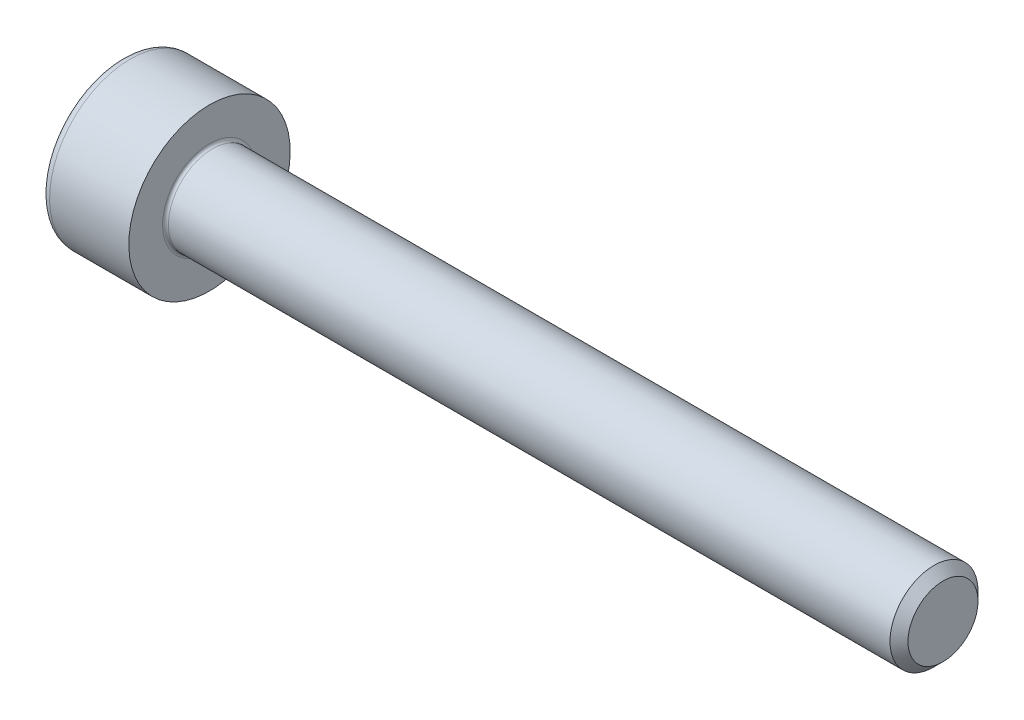
ISO-10303-21;
HEADER;
FILE_DESCRIPTION(('STEP AP214'),'2;1');
FILE_NAME('part.step','',(''),(''),'','','');
FILE_SCHEMA(('AUTOMOTIVE_DESIGN { 1 0 10303 214 1 1 1 1 }'));
ENDSEC;
DATA;
#1=APPLICATION_CONTEXT('core data for automotive mechanical design processes');
#2=APPLICATION_PROTOCOL_DEFINITION('international standard','automotive_design',2000,#1);
#3=PRODUCT_CONTEXT('',#1,'mechanical');
#4=PRODUCT('Part','Part','',(#3));
#5=PRODUCT_RELATED_PRODUCT_CATEGORY('part','',(#4));
#6=PRODUCT_DEFINITION_FORMATION('','',#4);
#7=PRODUCT_DEFINITION_CONTEXT('part definition',#1,'design');
#8=PRODUCT_DEFINITION('design','',#6,#7);
#9=PRODUCT_DEFINITION_SHAPE('','',#8);
#10=(LENGTH_UNIT() NAMED_UNIT(*) SI_UNIT(.MILLI.,.METRE.));
#11=(NAMED_UNIT(*) PLANE_ANGLE_UNIT() SI_UNIT($,.RADIAN.));
#12=(NAMED_UNIT(*) SI_UNIT($,.STERADIAN.) SOLID_ANGLE_UNIT());
#13=UNCERTAINTY_MEASURE_WITH_UNIT(LENGTH_MEASURE(1.E-05),#10,'distance_accuracy_value','');
#14=(GEOMETRIC_REPRESENTATION_CONTEXT(3) GLOBAL_UNCERTAINTY_ASSIGNED_CONTEXT((#13)) GLOBAL_UNIT_ASSIGNED_CONTEXT((#10,
#11,#12)) REPRESENTATION_CONTEXT('',''));
#15=CARTESIAN_POINT('',(0.,0.,0.));
#16=DIRECTION('',(0.,0.,1.));
#17=DIRECTION('',(1.,0.,0.));
#18=AXIS2_PLACEMENT_3D('',#15,#16,#17);
#19=CARTESIAN_POINT('',(-1.70499999995855,0.,0.));
#20=DIRECTION('',(-1.,0.,0.));
#21=DIRECTION('',(0.,0.,1.));
#22=AXIS2_PLACEMENT_3D('',#19,#20,#21);
#23=CONICAL_SURFACE('',#22,1.45203592694543,1.04719755118368);
#24=CARTESIAN_POINT('',(-0.866666666638594,0.,0.));
#25=VERTEX_POINT('',#24);
#26=VERTEX_LOOP('',#25);
#27=FACE_BOUND('',#26,.T.);
#28=CARTESIAN_POINT('',(-1.69999999999703,1.25,0.721687836487888));
#29=CARTESIAN_POINT('',(-1.68168471570057,1.25,0.658260217058919));
#30=CARTESIAN_POINT('',(-1.66502792318348,1.25,0.594285091321345));
#31=CARTESIAN_POINT('',(-1.63595399212002,1.25,0.46522715333814));
#32=CARTESIAN_POINT('',(-1.62354713770574,1.25,0.400142048729171));
#33=CARTESIAN_POINT('',(-1.60423497433511,1.25,0.270778406586236));
#34=CARTESIAN_POINT('',(-1.59720111724166,1.25,0.206519767731085));
#35=CARTESIAN_POINT('',(-1.58880573007492,1.25,0.0777002896402734));
#36=CARTESIAN_POINT('',(-1.58743724622727,1.25,0.0131399183071135));
#37=CARTESIAN_POINT('',(-1.59029143134034,1.25,-0.107484209658902));
#38=CARTESIAN_POINT('',(-1.59381330325391,1.25,-0.16356606692486));
#39=CARTESIAN_POINT('',(-1.604973312943,1.25,-0.275364426450217));
#40=CARTESIAN_POINT('',(-1.61261525922482,1.25,-0.331080542317558));
#41=CARTESIAN_POINT('',(-1.63171864583147,1.25,-0.443109217006952));
#42=CARTESIAN_POINT('',(-1.64326102638181,1.25,-0.499407604241041));
#43=CARTESIAN_POINT('',(-1.66945735052075,1.25,-0.611164931122247));
#44=CARTESIAN_POINT('',(-1.68410514296671,1.25,-0.666625301405443));
#45=CARTESIAN_POINT('',(-1.69999999999703,1.25,-0.72168783648789));
#46=B_SPLINE_CURVE_WITH_KNOTS('',3,(#28,#29,#30,#31,#32,#33,#34,#35,#36,#37,#38,#39,#40,#41,#42,
#43,#44,#45),.UNSPECIFIED.,.F.,.F.,(4,2,2,2,2,2,2,2,4),(0.,0.198135007224076,0.396746135644064,
0.590442253848449,0.783900555564741,0.952317364148294,1.12089012112463,1.29320101405853,
1.46517373344992),.UNSPECIFIED.);
#47=CARTESIAN_POINT('',(-1.69999999999703,1.25000000000037,0.721687836487247));
#48=VERTEX_POINT('',#47);
#49=CARTESIAN_POINT('',(-1.6999999999969,1.25,-0.721687836487461));
#50=VERTEX_POINT('',#49);
#51=EDGE_CURVE('E20',#48,#50,#46,.T.);
#52=ORIENTED_EDGE('',*,*,#51,.T.);
#53=CARTESIAN_POINT('',(-1.69999999999703,1.25000000000074,-0.721687836486606));
#54=CARTESIAN_POINT('',(-1.68168471570057,1.19507007027368,-0.753401646201091));
#55=CARTESIAN_POINT('',(-1.66502792318348,1.13966598617464,-0.785389209069878));
#56=CARTESIAN_POINT('',(-1.63595399212002,1.02789853332115,-0.84991817806148));
#57=CARTESIAN_POINT('',(-1.62354713770574,0.971533179321811,-0.882460730365965));
#58=CARTESIAN_POINT('',(-1.60423497433511,0.85950097889995,-0.947142551437432));
#59=CARTESIAN_POINT('',(-1.59720111724167,0.80385136523878,-0.979271870865007));
#60=CARTESIAN_POINT('',(-1.58880573007492,0.692290424709884,-1.04368160991041));
#61=CARTESIAN_POINT('',(-1.58743724622727,0.636379503057611,-1.07596179557699));
#62=CARTESIAN_POINT('',(-1.59029143134034,0.531915943929697,-1.13627385956));
#63=CARTESIAN_POINT('',(-1.59381330325391,0.483347630845964,-1.16431478819298));
#64=CARTESIAN_POINT('',(-1.604973312943,0.386527411395579,-1.22021396795566));
#65=CARTESIAN_POINT('',(-1.61261525922482,0.338275839654265,-1.24807202588933));
#66=CARTESIAN_POINT('',(-1.63171864583147,0.241256161420947,-1.30408636323403));
#67=CARTESIAN_POINT('',(-1.64326102638182,0.192500327884133,-1.33223555685107));
#68=CARTESIAN_POINT('',(-1.66945735052075,0.0957156437459675,-1.38811422029167));
#69=CARTESIAN_POINT('',(-1.68410514296671,0.0476855541774276,-1.41584440543327));
#70=CARTESIAN_POINT('',(-1.69999999999703,-7.42934727826491E-13,-1.44337567297449));
#71=B_SPLINE_CURVE_WITH_KNOTS('',3,(#53,#54,#55,#56,#57,#58,#59,#60,#61,#62,#63,#64,#65,#66,#67,
#68,#69,#70),.UNSPECIFIED.,.F.,.F.,(4,2,2,2,2,2,2,2,4),(0.,0.198135007224076,0.396746135644064,
0.590442253848448,0.783900555564741,0.952317364148293,1.12089012112463,1.29320101405852,
1.46517373344991),.UNSPECIFIED.);
#72=CARTESIAN_POINT('',(-1.69999999999703,0.,-1.4433756729745));
#73=VERTEX_POINT('',#72);
#74=EDGE_CURVE('E81',#50,#73,#71,.T.);
#75=ORIENTED_EDGE('',*,*,#74,.T.);
#76=CARTESIAN_POINT('',(-1.69999999999703,7.37871499272077E-13,-1.4433756729745));
#77=CARTESIAN_POINT('',(-1.68168471570057,-0.0549299297263211,-1.41166186326001));
#78=CARTESIAN_POINT('',(-1.66502792318348,-0.110334013825364,-1.37967430039122));
#79=CARTESIAN_POINT('',(-1.63595399212002,-0.222101466678857,-1.31514533139962));
#80=CARTESIAN_POINT('',(-1.62354713770574,-0.278466820678191,-1.28260277909514));
#81=CARTESIAN_POINT('',(-1.60423497433511,-0.390499021100053,-1.21792095802367));
#82=CARTESIAN_POINT('',(-1.59720111724167,-0.446148634761223,-1.18579163859609));
#83=CARTESIAN_POINT('',(-1.58880573007492,-0.55770957529012,-1.12138189955069));
#84=CARTESIAN_POINT('',(-1.58743724622727,-0.613620496942393,-1.08910171388411));
#85=CARTESIAN_POINT('',(-1.59029143134035,-0.718084056070307,-1.0287896499011));
#86=CARTESIAN_POINT('',(-1.59381330325391,-0.766652369154039,-1.00074872126812));
#87=CARTESIAN_POINT('',(-1.604973312943,-0.863472588604424,-0.944849541505444));
#88=CARTESIAN_POINT('',(-1.61261525922483,-0.911724160345738,-0.916991483571773));
#89=CARTESIAN_POINT('',(-1.63171864583147,-1.00874383857905,-0.860977146227077));
#90=CARTESIAN_POINT('',(-1.64326102638182,-1.05749967211587,-0.832827952610033));
#91=CARTESIAN_POINT('',(-1.66945735052075,-1.15428435625403,-0.776949289169431));
#92=CARTESIAN_POINT('',(-1.68410514296671,-1.20231444582257,-0.749219104027832));
#93=CARTESIAN_POINT('',(-1.69999999999703,-1.25000000000074,-0.721687836486609));
#94=B_SPLINE_CURVE_WITH_KNOTS('',3,(#76,#77,#78,#79,#80,#81,#82,#83,#84,#85,#86,#87,#88,#89,#90,
#91,#92,#93),.UNSPECIFIED.,.F.,.F.,(4,2,2,2,2,2,2,2,4),(0.,0.198135007224076,0.396746135644066,
0.59044225384845,0.783900555564743,0.952317364148295,1.12089012112463,1.29320101405852,
1.46517373344991),.UNSPECIFIED.);
#95=CARTESIAN_POINT('',(-1.69999999999703,-1.25000000000037,-0.72168783648725));
#96=VERTEX_POINT('',#95);
#97=EDGE_CURVE('E107',#73,#96,#94,.T.);
#98=ORIENTED_EDGE('',*,*,#97,.T.);
#99=CARTESIAN_POINT('',(-1.69999999999703,-1.25,-0.72168783648789));
#100=CARTESIAN_POINT('',(-1.68168471570057,-1.25,-0.658260217058921));
#101=CARTESIAN_POINT('',(-1.66502792318348,-1.25,-0.594285091321346));
#102=CARTESIAN_POINT('',(-1.63595399212002,-1.25,-0.465227153338142));
#103=CARTESIAN_POINT('',(-1.62354713770574,-1.25,-0.400142048729173));
#104=CARTESIAN_POINT('',(-1.60423497433511,-1.25,-0.270778406586237));
#105=CARTESIAN_POINT('',(-1.59720111724167,-1.25,-0.206519767731087));
#106=CARTESIAN_POINT('',(-1.58880573007492,-1.25,-0.0777002896402751));
#107=CARTESIAN_POINT('',(-1.58743724622727,-1.25,-0.0131399183071152));
#108=CARTESIAN_POINT('',(-1.59029143134034,-1.25,0.1074842096589));
#109=CARTESIAN_POINT('',(-1.59381330325391,-1.25,0.163566066924858));
#110=CARTESIAN_POINT('',(-1.604973312943,-1.25,0.275364426450216));
#111=CARTESIAN_POINT('',(-1.61261525922482,-1.25,0.331080542317556));
#112=CARTESIAN_POINT('',(-1.63171864583147,-1.25,0.44310921700695));
#113=CARTESIAN_POINT('',(-1.64326102638181,-1.25,0.499407604241038));
#114=CARTESIAN_POINT('',(-1.66945735052075,-1.25,0.611164931122244));
#115=CARTESIAN_POINT('',(-1.68410514296671,-1.25,0.666625301405441));
#116=CARTESIAN_POINT('',(-1.69999999999703,-1.25,0.721687836487888));
#117=B_SPLINE_CURVE_WITH_KNOTS('',3,(#99,#100,#101,#102,#103,#104,#105,#106,#107,#108,#109,#110,
#111,#112,#113,#114,#115,#116),.UNSPECIFIED.,.F.,.F.,(4,2,2,2,2,2,2,2,4),(0.,0.198135007224076,
0.396746135644065,0.590442253848449,0.783900555564741,0.952317364148294,1.12089012112463,
1.29320101405853,1.46517373344992),.UNSPECIFIED.);
#118=CARTESIAN_POINT('',(-1.69999999999703,-1.25000000000037,0.721687836487246));
#119=VERTEX_POINT('',#118);
#120=EDGE_CURVE('E132',#96,#119,#117,.T.);
#121=ORIENTED_EDGE('',*,*,#120,.T.);
#122=CARTESIAN_POINT('',(-1.69999999999703,-1.25000000000074,0.721687836486605));
#123=CARTESIAN_POINT('',(-1.68168471570057,-1.19507007027368,0.75340164620109));
#124=CARTESIAN_POINT('',(-1.66502792318348,-1.13966598617464,0.785389209069877));
#125=CARTESIAN_POINT('',(-1.63595399212002,-1.02789853332115,0.849918178061479));
#126=CARTESIAN_POINT('',(-1.62354713770574,-0.971533179321813,0.882460730365964));
#127=CARTESIAN_POINT('',(-1.60423497433511,-0.859500978899952,0.947142551437431));
#128=CARTESIAN_POINT('',(-1.59720111724167,-0.803851365238782,0.979271870865006));
#129=CARTESIAN_POINT('',(-1.58880573007492,-0.692290424709886,1.04368160991041));
#130=CARTESIAN_POINT('',(-1.58743724622727,-0.636379503057612,1.07596179557699));
#131=CARTESIAN_POINT('',(-1.59029143134034,-0.531915943929698,1.13627385956));
#132=CARTESIAN_POINT('',(-1.59381330325391,-0.483347630845966,1.16431478819298));
#133=CARTESIAN_POINT('',(-1.604973312943,-0.38652741139558,1.22021396795566));
#134=CARTESIAN_POINT('',(-1.61261525922482,-0.338275839654266,1.24807202588933));
#135=CARTESIAN_POINT('',(-1.63171864583147,-0.241256161420948,1.30408636323402));
#136=CARTESIAN_POINT('',(-1.64326102638182,-0.192500327884134,1.33223555685107));
#137=CARTESIAN_POINT('',(-1.66945735052075,-0.095715643745968,1.38811422029167));
#138=CARTESIAN_POINT('',(-1.68410514296671,-0.0476855541774282,1.41584440543327));
#139=CARTESIAN_POINT('',(-1.69999999999703,7.42500278451778E-13,1.44337567297449));
#140=B_SPLINE_CURVE_WITH_KNOTS('',3,(#122,#123,#124,#125,#126,#127,#128,#129,#130,#131,#132,
#133,#134,#135,#136,#137,#138,#139),.UNSPECIFIED.,.F.,.F.,(4,2,2,2,2,2,2,2,4),(0.,
0.198135007224075,0.396746135644065,0.590442253848449,0.783900555564742,0.952317364148295,
1.12089012112463,1.29320101405853,1.46517373344992),.UNSPECIFIED.);
#141=CARTESIAN_POINT('',(-1.69999999999703,0.,1.4433756729745));
#142=VERTEX_POINT('',#141);
#143=EDGE_CURVE('E141',#119,#142,#140,.T.);
#144=ORIENTED_EDGE('',*,*,#143,.T.);
#145=CARTESIAN_POINT('',(-1.69999999999703,-7.3880623636775E-13,1.4433756729745));
#146=CARTESIAN_POINT('',(-1.68168471570057,0.0549299297263202,1.41166186326001));
#147=CARTESIAN_POINT('',(-1.66502792318348,0.110334013825363,1.37967430039122));
#148=CARTESIAN_POINT('',(-1.63595399212002,0.222101466678855,1.31514533139962));
#149=CARTESIAN_POINT('',(-1.62354713770574,0.27846682067819,1.28260277909514));
#150=CARTESIAN_POINT('',(-1.60423497433511,0.390499021100052,1.21792095802367));
#151=CARTESIAN_POINT('',(-1.59720111724167,0.446148634761222,1.18579163859609));
#152=CARTESIAN_POINT('',(-1.58880573007492,0.557709575290118,1.12138189955069));
#153=CARTESIAN_POINT('',(-1.58743724622727,0.613620496942391,1.08910171388411));
#154=CARTESIAN_POINT('',(-1.59029143134034,0.718084056070306,1.0287896499011));
#155=CARTESIAN_POINT('',(-1.59381330325391,0.766652369154038,1.00074872126812));
#156=CARTESIAN_POINT('',(-1.604973312943,0.863472588604423,0.944849541505442));
#157=CARTESIAN_POINT('',(-1.61261525922482,0.911724160345737,0.916991483571772));
#158=CARTESIAN_POINT('',(-1.63171864583147,1.00874383857905,0.860977146227076));
#159=CARTESIAN_POINT('',(-1.64326102638182,1.05749967211587,0.832827952610031));
#160=CARTESIAN_POINT('',(-1.66945735052075,1.15428435625403,0.776949289169429));
#161=CARTESIAN_POINT('',(-1.68410514296671,1.20231444582257,0.74921910402783));
#162=CARTESIAN_POINT('',(-1.69999999999703,1.25000000000074,0.721687836486607));
#163=B_SPLINE_CURVE_WITH_KNOTS('',3,(#145,#146,#147,#148,#149,#150,#151,#152,#153,#154,#155,
#156,#157,#158,#159,#160,#161,#162),.UNSPECIFIED.,.F.,.F.,(4,2,2,2,2,2,2,2,4),(0.,
0.198135007224076,0.396746135644066,0.59044225384845,0.783900555564744,0.952317364148296,
1.12089012112463,1.29320101405853,1.46517373344991),.UNSPECIFIED.);
#164=EDGE_CURVE('E83',#142,#48,#163,.T.);
#165=ORIENTED_EDGE('',*,*,#164,.T.);
#166=EDGE_LOOP('',(#52,#75,#98,#121,#144,#165));
#167=FACE_BOUND('',#166,.T.);
#168=ADVANCED_FACE('F16',(#27,#167),#23,.F.);
#169=CARTESIAN_POINT('',(-2.99999999999999,1.25,0.721687836487031));
#170=DIRECTION('',(0.,1.,0.));
#171=DIRECTION('',(0.,0.,1.));
#172=AXIS2_PLACEMENT_3D('',#169,#170,#171);
#173=PLANE('',#172);
#174=DIRECTION('',(1.,0.,0.));
#175=VECTOR('',#174,1.);
#176=CARTESIAN_POINT('',(-2.99999999999999,1.25,0.721687836487034));
#177=LINE('',#176,#175);
#178=CARTESIAN_POINT('',(-2.99999999999999,1.25,0.721687836487032));
#179=VERTEX_POINT('',#178);
#180=EDGE_CURVE('E85',#48,#179,#177,.F.);
#181=ORIENTED_EDGE('',*,*,#180,.T.);
#182=DIRECTION('',(0.,0.,1.));
#183=VECTOR('',#182,1.);
#184=CARTESIAN_POINT('',(-2.99999999999999,1.25,0.));
#185=LINE('',#184,#183);
#186=CARTESIAN_POINT('',(-2.99999999999999,1.25,-0.721687836487033));
#187=VERTEX_POINT('',#186);
#188=EDGE_CURVE('E90',#187,#179,#185,.T.);
#189=ORIENTED_EDGE('',*,*,#188,.F.);
#190=DIRECTION('',(1.,0.,0.));
#191=VECTOR('',#190,1.);
#192=CARTESIAN_POINT('',(-2.99999999999999,1.25,-0.721687836487033));
#193=LINE('',#192,#191);
#194=EDGE_CURVE('E88',#187,#50,#193,.T.);
#195=ORIENTED_EDGE('',*,*,#194,.T.);
#196=ORIENTED_EDGE('',*,*,#51,.F.);
#197=EDGE_LOOP('',(#181,#189,#195,#196));
#198=FACE_BOUND('',#197,.T.);
#199=ADVANCED_FACE('F77',(#198),#173,.F.);
#200=CARTESIAN_POINT('',(-2.99999999999999,0.,1.44337567297407));
#201=DIRECTION('',(0.,0.500000000000001,0.866025403784438));
#202=DIRECTION('',(0.,-0.866025403784438,0.500000000000001));
#203=AXIS2_PLACEMENT_3D('',#200,#201,#202);
#204=PLANE('',#203);
#205=DIRECTION('',(1.,0.,0.));
#206=VECTOR('',#205,1.);
#207=CARTESIAN_POINT('',(-2.99999999999999,0.,1.44337567297407));
#208=LINE('',#207,#206);
#209=CARTESIAN_POINT('',(-2.99999999999999,0.,1.44337567297407));
#210=VERTEX_POINT('',#209);
#211=EDGE_CURVE('E146',#142,#210,#208,.F.);
#212=ORIENTED_EDGE('',*,*,#211,.T.);
#213=DIRECTION('',(0.,-0.866025403784437,0.500000000000004));
#214=VECTOR('',#213,1.);
#215=CARTESIAN_POINT('',(-2.99999999999999,1.25,0.721687836487031));
#216=LINE('',#215,#214);
#217=EDGE_CURVE('E96',#179,#210,#216,.T.);
#218=ORIENTED_EDGE('',*,*,#217,.F.);
#219=ORIENTED_EDGE('',*,*,#180,.F.);
#220=ORIENTED_EDGE('',*,*,#164,.F.);
#221=EDGE_LOOP('',(#212,#218,#219,#220));
#222=FACE_BOUND('',#221,.T.);
#223=ADVANCED_FACE('F151',(#222),#204,.F.);
#224=CARTESIAN_POINT('',(-2.99999999999999,-1.25,0.721687836487033));
#225=DIRECTION('',(0.,-0.5,0.866025403784439));
#226=DIRECTION('',(0.,-0.866025403784439,-0.5));
#227=AXIS2_PLACEMENT_3D('',#224,#225,#226);
#228=PLANE('',#227);
#229=DIRECTION('',(1.,0.,0.));
#230=VECTOR('',#229,1.);
#231=CARTESIAN_POINT('',(-2.99999999999999,-1.25,0.721687836487032));
#232=LINE('',#231,#230);
#233=CARTESIAN_POINT('',(-2.99999999999999,-1.25,0.721687836487032));
#234=VERTEX_POINT('',#233);
#235=EDGE_CURVE('E140',#119,#234,#232,.F.);
#236=ORIENTED_EDGE('',*,*,#235,.T.);
#237=DIRECTION('',(0.,-0.866025403784437,-0.500000000000003));
#238=VECTOR('',#237,1.);
#239=CARTESIAN_POINT('',(-2.99999999999999,0.,1.44337567297407));
#240=LINE('',#239,#238);
#241=EDGE_CURVE('E270',#210,#234,#240,.T.);
#242=ORIENTED_EDGE('',*,*,#241,.F.);
#243=ORIENTED_EDGE('',*,*,#211,.F.);
#244=ORIENTED_EDGE('',*,*,#143,.F.);
#245=EDGE_LOOP('',(#236,#242,#243,#244));
#246=FACE_BOUND('',#245,.T.);
#247=ADVANCED_FACE('F128',(#246),#228,.F.);
#248=CARTESIAN_POINT('',(-2.99999999999999,-1.25,-0.721687836487032));
#249=DIRECTION('',(0.,-1.,0.));
#250=DIRECTION('',(1.,0.,0.));
#251=AXIS2_PLACEMENT_3D('',#248,#249,#250);
#252=PLANE('',#251);
#253=DIRECTION('',(1.,0.,0.));
#254=VECTOR('',#253,1.);
#255=CARTESIAN_POINT('',(-2.99999999999999,-1.25,-0.721687836487037));
#256=LINE('',#255,#254);
#257=CARTESIAN_POINT('',(-2.99999999999999,-1.25,-0.721687836487034));
#258=VERTEX_POINT('',#257);
#259=EDGE_CURVE('E139',#96,#258,#256,.F.);
#260=ORIENTED_EDGE('',*,*,#259,.T.);
#261=DIRECTION('',(0.,0.,1.));
#262=VECTOR('',#261,1.);
#263=CARTESIAN_POINT('',(-2.99999999999999,-1.25,0.));
#264=LINE('',#263,#262);
#265=EDGE_CURVE('E265',#234,#258,#264,.F.);
#266=ORIENTED_EDGE('',*,*,#265,.F.);
#267=ORIENTED_EDGE('',*,*,#235,.F.);
#268=ORIENTED_EDGE('',*,*,#120,.F.);
#269=EDGE_LOOP('',(#260,#266,#267,#268));
#270=FACE_BOUND('',#269,.T.);
#271=ADVANCED_FACE('F124',(#270),#252,.F.);
#272=CARTESIAN_POINT('',(-2.99999999999999,0.,-1.44337567297407));
#273=DIRECTION('',(0.,-0.5,-0.866025403784439));
#274=DIRECTION('',(0.,0.866025403784439,-0.5));
#275=AXIS2_PLACEMENT_3D('',#272,#273,#274);
#276=PLANE('',#275);
#277=DIRECTION('',(1.,0.,0.));
#278=VECTOR('',#277,1.);
#279=CARTESIAN_POINT('',(-2.99999999999999,0.,-1.44337567297407));
#280=LINE('',#279,#278);
#281=CARTESIAN_POINT('',(-2.99999999999999,0.,-1.44337567297407));
#282=VERTEX_POINT('',#281);
#283=EDGE_CURVE('E39',#73,#282,#280,.F.);
#284=ORIENTED_EDGE('',*,*,#283,.T.);
#285=DIRECTION('',(0.,0.866025403784437,-0.500000000000003));
#286=VECTOR('',#285,1.);
#287=CARTESIAN_POINT('',(-2.99999999999999,-1.25,-0.721687836487032));
#288=LINE('',#287,#286);
#289=EDGE_CURVE('E260',#258,#282,#288,.T.);
#290=ORIENTED_EDGE('',*,*,#289,.F.);
#291=ORIENTED_EDGE('',*,*,#259,.F.);
#292=ORIENTED_EDGE('',*,*,#97,.F.);
#293=EDGE_LOOP('',(#284,#290,#291,#292));
#294=FACE_BOUND('',#293,.T.);
#295=ADVANCED_FACE('F118',(#294),#276,.F.);
#296=CARTESIAN_POINT('',(-2.99999999999999,1.25,-0.721687836487033));
#297=DIRECTION('',(0.,0.5,-0.866025403784439));
#298=DIRECTION('',(0.,0.866025403784439,0.5));
#299=AXIS2_PLACEMENT_3D('',#296,#297,#298);
#300=PLANE('',#299);
#301=ORIENTED_EDGE('',*,*,#194,.F.);
#302=DIRECTION('',(0.,0.866025403784437,0.500000000000002));
#303=VECTOR('',#302,1.);
#304=CARTESIAN_POINT('',(-2.99999999999999,0.,-1.44337567297407));
#305=LINE('',#304,#303);
#306=EDGE_CURVE('E258',#282,#187,#305,.T.);
#307=ORIENTED_EDGE('',*,*,#306,.F.);
#308=ORIENTED_EDGE('',*,*,#283,.F.);
#309=ORIENTED_EDGE('',*,*,#74,.F.);
#310=EDGE_LOOP('',(#301,#307,#308,#309));
#311=FACE_BOUND('',#310,.T.);
#312=ADVANCED_FACE('F94',(#311),#300,.F.);
#313=CARTESIAN_POINT('',(-2.99999999999999,2.09668783648703,0.));
#314=DIRECTION('',(-1.,0.,0.));
#315=DIRECTION('',(0.,-1.,0.));
#316=AXIS2_PLACEMENT_3D('',#313,#314,#315);
#317=PLANE('',#316);
#318=ORIENTED_EDGE('',*,*,#289,.T.);
#319=ORIENTED_EDGE('',*,*,#306,.T.);
#320=ORIENTED_EDGE('',*,*,#188,.T.);
#321=ORIENTED_EDGE('',*,*,#217,.T.);
#322=ORIENTED_EDGE('',*,*,#241,.T.);
#323=ORIENTED_EDGE('',*,*,#265,.T.);
#324=EDGE_LOOP('',(#318,#319,#320,#321,#322,#323));
#325=FACE_BOUND('',#324,.T.);
#326=CARTESIAN_POINT('',(-2.99999999999999,0.,0.));
#327=DIRECTION('',(1.,0.,0.));
#328=DIRECTION('',(0.,1.,0.));
#329=AXIS2_PLACEMENT_3D('',#326,#327,#328);
#330=CIRCLE('',#329,2.45);
#331=CARTESIAN_POINT('',(-2.99999999999999,2.45,0.));
#332=VERTEX_POINT('',#331);
#333=EDGE_CURVE('E221',#332,#332,#330,.T.);
#334=ORIENTED_EDGE('',*,*,#333,.F.);
#335=EDGE_LOOP('',(#334));
#336=FACE_BOUND('',#335,.T.);
#337=ADVANCED_FACE('F117',(#325,#336),#317,.T.);
#338=CARTESIAN_POINT('',(-2.69999999999999,0.,0.));
#339=DIRECTION('',(1.,0.,0.));
#340=DIRECTION('',(0.,0.,-1.));
#341=AXIS2_PLACEMENT_3D('',#338,#339,#340);
#342=TOROIDAL_SURFACE('',#341,2.45,0.3);
#343=CARTESIAN_POINT('',(-2.69999999999999,0.,0.));
#344=DIRECTION('',(1.,0.,0.));
#345=DIRECTION('',(0.,1.,0.));
#346=AXIS2_PLACEMENT_3D('',#343,#344,#345);
#347=CIRCLE('',#346,2.75);
#348=CARTESIAN_POINT('',(-2.69999999999999,2.75,0.));
#349=VERTEX_POINT('',#348);
#350=EDGE_CURVE('E285',#349,#349,#347,.T.);
#351=ORIENTED_EDGE('',*,*,#350,.F.);
#352=EDGE_LOOP('',(#351));
#353=FACE_BOUND('',#352,.T.);
#354=ORIENTED_EDGE('',*,*,#333,.T.);
#355=EDGE_LOOP('',(#354));
#356=FACE_BOUND('',#355,.T.);
#357=ADVANCED_FACE('F205',(#353,#356),#342,.T.);
#358=CARTESIAN_POINT('',(-1.49999999999999,0.,0.));
#359=DIRECTION('',(1.,0.,0.));
#360=DIRECTION('',(0.,1.,0.));
#361=AXIS2_PLACEMENT_3D('',#358,#359,#360);
#362=CYLINDRICAL_SURFACE('',#361,2.75);
#363=ORIENTED_EDGE('',*,*,#350,.T.);
#364=EDGE_LOOP('',(#363));
#365=FACE_BOUND('',#364,.T.);
#366=CARTESIAN_POINT('',(0.,0.,0.));
#367=DIRECTION('',(1.,0.,0.));
#368=DIRECTION('',(0.,1.,0.));
#369=AXIS2_PLACEMENT_3D('',#366,#367,#368);
#370=CIRCLE('',#369,2.75);
#371=CARTESIAN_POINT('',(0.,2.75,0.));
#372=VERTEX_POINT('',#371);
#373=EDGE_CURVE('E105',#372,#372,#370,.T.);
#374=ORIENTED_EDGE('',*,*,#373,.F.);
#375=EDGE_LOOP('',(#374));
#376=FACE_BOUND('',#375,.T.);
#377=ADVANCED_FACE('F202',(#365,#376),#362,.T.);
#378=CARTESIAN_POINT('',(25.,0.75,0.));
#379=DIRECTION('',(1.,0.,0.));
#380=DIRECTION('',(0.,1.,0.));
#381=AXIS2_PLACEMENT_3D('',#378,#379,#380);
#382=PLANE('',#381);
#383=CARTESIAN_POINT('',(24.9999999999773,0.,0.));
#384=DIRECTION('',(-1.,0.,0.));
#385=DIRECTION('',(0.,0.,1.));
#386=AXIS2_PLACEMENT_3D('',#383,#384,#385);
#387=CIRCLE('',#386,1.19327500004829);
#388=CARTESIAN_POINT('',(24.9999999999773,0.,1.19327500004829));
#389=VERTEX_POINT('',#388);
#390=EDGE_CURVE('E280',#389,#389,#387,.T.);
#391=ORIENTED_EDGE('',*,*,#390,.F.);
#392=EDGE_LOOP('',(#391));
#393=FACE_BOUND('',#392,.T.);
#394=ADVANCED_FACE('F199',(#393),#382,.T.);
#395=CARTESIAN_POINT('',(0.,2.125,0.));
#396=DIRECTION('',(1.,0.,0.));
#397=DIRECTION('',(0.,1.,0.));
#398=AXIS2_PLACEMENT_3D('',#395,#396,#397);
#399=PLANE('',#398);
#400=CARTESIAN_POINT('',(0.,0.,0.));
#401=DIRECTION('',(1.,0.,0.));
#402=DIRECTION('',(0.,1.,0.));
#403=AXIS2_PLACEMENT_3D('',#400,#401,#402);
#404=CIRCLE('',#403,1.6);
#405=CARTESIAN_POINT('',(0.,1.6,0.));
#406=VERTEX_POINT('',#405);
#407=EDGE_CURVE('E186',#406,#406,#404,.F.);
#408=ORIENTED_EDGE('',*,*,#407,.T.);
#409=EDGE_LOOP('',(#408));
#410=FACE_BOUND('',#409,.T.);
#411=ORIENTED_EDGE('',*,*,#373,.T.);
#412=EDGE_LOOP('',(#411));
#413=FACE_BOUND('',#412,.T.);
#414=ADVANCED_FACE('F190',(#410,#413),#399,.T.);
#415=CARTESIAN_POINT('',(24.6932750001179,0.,0.));
#416=DIRECTION('',(-1.,0.,0.));
#417=DIRECTION('',(0.,0.,1.));
#418=AXIS2_PLACEMENT_3D('',#415,#416,#417);
#419=CONICAL_SURFACE('',#418,1.49999999990769,0.785398163397448);
#420=ORIENTED_EDGE('',*,*,#390,.T.);
#421=EDGE_LOOP('',(#420));
#422=FACE_BOUND('',#421,.T.);
#423=CARTESIAN_POINT('',(24.693275,0.,0.));
#424=DIRECTION('',(1.,0.,0.));
#425=DIRECTION('',(0.,1.,0.));
#426=AXIS2_PLACEMENT_3D('',#423,#424,#425);
#427=CIRCLE('',#426,1.5);
#428=CARTESIAN_POINT('',(24.693275,1.5,0.));
#429=VERTEX_POINT('',#428);
#430=EDGE_CURVE('E30',#429,#429,#427,.F.);
#431=ORIENTED_EDGE('',*,*,#430,.F.);
#432=EDGE_LOOP('',(#431));
#433=FACE_BOUND('',#432,.T.);
#434=ADVANCED_FACE('F168',(#422,#433),#419,.T.);
#435=CARTESIAN_POINT('',(0.100000000000002,0.,0.));
#436=DIRECTION('',(1.,0.,0.));
#437=DIRECTION('',(0.,0.,-1.));
#438=AXIS2_PLACEMENT_3D('',#435,#436,#437);
#439=TOROIDAL_SURFACE('',#438,1.6,0.1);
#440=CARTESIAN_POINT('',(0.100000000000003,0.,0.));
#441=DIRECTION('',(1.,0.,0.));
#442=DIRECTION('',(0.,1.,0.));
#443=AXIS2_PLACEMENT_3D('',#440,#441,#442);
#444=CIRCLE('',#443,1.5);
#445=CARTESIAN_POINT('',(0.100000000000003,1.5,0.));
#446=VERTEX_POINT('',#445);
#447=EDGE_CURVE('E11',#446,#446,#444,.T.);
#448=ORIENTED_EDGE('',*,*,#447,.F.);
#449=EDGE_LOOP('',(#448));
#450=FACE_BOUND('',#449,.T.);
#451=ORIENTED_EDGE('',*,*,#407,.F.);
#452=EDGE_LOOP('',(#451));
#453=FACE_BOUND('',#452,.T.);
#454=ADVANCED_FACE('F162',(#450,#453),#439,.F.);
#455=CARTESIAN_POINT('',(16.,0.,0.));
#456=DIRECTION('',(1.,0.,0.));
#457=DIRECTION('',(0.,1.,0.));
#458=AXIS2_PLACEMENT_3D('',#455,#456,#457);
#459=CYLINDRICAL_SURFACE('',#458,1.5);
#460=ORIENTED_EDGE('',*,*,#447,.T.);
#461=EDGE_LOOP('',(#460));
#462=FACE_BOUND('',#461,.T.);
#463=ORIENTED_EDGE('',*,*,#430,.T.);
#464=EDGE_LOOP('',(#463));
#465=FACE_BOUND('',#464,.T.);
#466=ADVANCED_FACE('F160',(#462,#465),#459,.T.);
#467=CLOSED_SHELL('',(#168,#199,#223,#247,#271,#295,#312,#337,#357,#377,#394,#414,#434,#454,#466));
#468=MANIFOLD_SOLID_BREP('B1',#467);
#469=ADVANCED_BREP_SHAPE_REPRESENTATION('',(#18,#468),#14);
#470=SHAPE_DEFINITION_REPRESENTATION(#9,#469);
ENDSEC;
END-ISO-10303-21;
